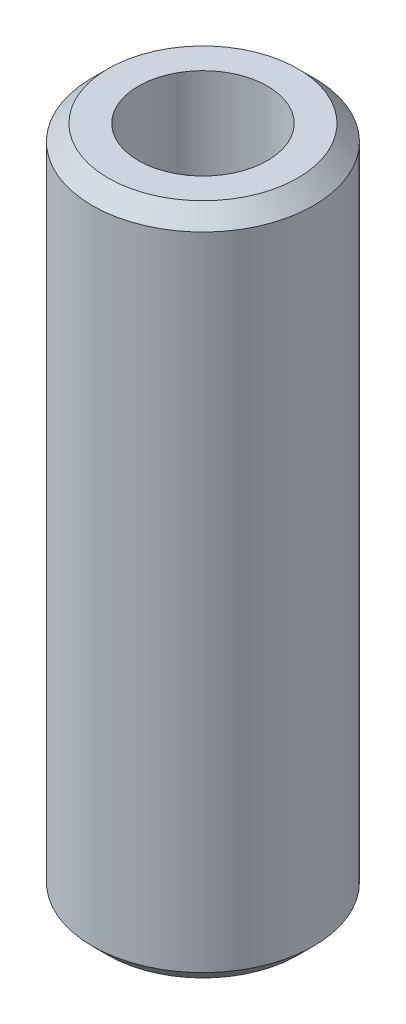
ISO-10303-21;
HEADER;
FILE_DESCRIPTION(('STEP AP214'),'2;1');
FILE_NAME('part.step','',(''),(''),'','','');
FILE_SCHEMA(('AUTOMOTIVE_DESIGN { 1 0 10303 214 1 1 1 1 }'));
ENDSEC;
DATA;
#1=APPLICATION_CONTEXT('core data for automotive mechanical design processes');
#2=APPLICATION_PROTOCOL_DEFINITION('international standard','automotive_design',2000,#1);
#3=PRODUCT_CONTEXT('',#1,'mechanical');
#4=PRODUCT('Part','Part','',(#3));
#5=PRODUCT_RELATED_PRODUCT_CATEGORY('part','',(#4));
#6=PRODUCT_DEFINITION_FORMATION('','',#4);
#7=PRODUCT_DEFINITION_CONTEXT('part definition',#1,'design');
#8=PRODUCT_DEFINITION('design','',#6,#7);
#9=PRODUCT_DEFINITION_SHAPE('','',#8);
#10=(LENGTH_UNIT() NAMED_UNIT(*) SI_UNIT(.MILLI.,.METRE.));
#11=(NAMED_UNIT(*) PLANE_ANGLE_UNIT() SI_UNIT($,.RADIAN.));
#12=(NAMED_UNIT(*) SI_UNIT($,.STERADIAN.) SOLID_ANGLE_UNIT());
#13=UNCERTAINTY_MEASURE_WITH_UNIT(LENGTH_MEASURE(1.E-05),#10,'distance_accuracy_value','');
#14=(GEOMETRIC_REPRESENTATION_CONTEXT(3) GLOBAL_UNCERTAINTY_ASSIGNED_CONTEXT((#13)) GLOBAL_UNIT_ASSIGNED_CONTEXT((#10,
#11,#12)) REPRESENTATION_CONTEXT('',''));
#15=CARTESIAN_POINT('',(0.,0.,0.));
#16=DIRECTION('',(0.,0.,1.));
#17=DIRECTION('',(1.,0.,0.));
#18=AXIS2_PLACEMENT_3D('',#15,#16,#17);
#19=CARTESIAN_POINT('',(0.,152.026612046149,0.));
#20=DIRECTION('',(0.,-1.,0.));
#21=DIRECTION('',(0.,0.,-1.));
#22=AXIS2_PLACEMENT_3D('',#19,#20,#21);
#23=CYLINDRICAL_SURFACE('',#22,25.);
#24=CARTESIAN_POINT('',(0.,148.439492911582,0.));
#25=DIRECTION('',(0.,1.,0.));
#26=DIRECTION('',(0.,0.,1.));
#27=AXIS2_PLACEMENT_3D('',#24,#25,#26);
#28=CIRCLE('',#27,25.);
#29=CARTESIAN_POINT('',(0.,148.439492911582,25.));
#30=VERTEX_POINT('',#29);
#31=EDGE_CURVE('E50',#30,#30,#28,.F.);
#32=ORIENTED_EDGE('',*,*,#31,.T.);
#33=EDGE_LOOP('',(#32));
#34=FACE_BOUND('',#33,.T.);
#35=CARTESIAN_POINT('',(0.,3.58711913456675,0.));
#36=DIRECTION('',(0.,1.,0.));
#37=DIRECTION('',(0.,0.,1.));
#38=AXIS2_PLACEMENT_3D('',#35,#36,#37);
#39=CIRCLE('',#38,25.);
#40=CARTESIAN_POINT('',(0.,3.58711913456675,25.));
#41=VERTEX_POINT('',#40);
#42=EDGE_CURVE('E51',#41,#41,#39,.T.);
#43=ORIENTED_EDGE('',*,*,#42,.T.);
#44=EDGE_LOOP('',(#43));
#45=FACE_BOUND('',#44,.T.);
#46=ADVANCED_FACE('F39',(#34,#45),#23,.T.);
#47=CARTESIAN_POINT('',(0.,152.026612046149,0.));
#48=DIRECTION('',(0.,1.,0.));
#49=DIRECTION('',(0.,0.,1.));
#50=AXIS2_PLACEMENT_3D('',#47,#48,#49);
#51=PLANE('',#50);
#52=CARTESIAN_POINT('',(0.,152.026612046149,0.));
#53=DIRECTION('',(0.,1.,0.));
#54=DIRECTION('',(0.,0.,1.));
#55=AXIS2_PLACEMENT_3D('',#52,#53,#54);
#56=CIRCLE('',#55,21.4128808654332);
#57=CARTESIAN_POINT('',(0.,152.026612046149,21.4128808654332));
#58=VERTEX_POINT('',#57);
#59=EDGE_CURVE('E54',#58,#58,#56,.T.);
#60=ORIENTED_EDGE('',*,*,#59,.T.);
#61=EDGE_LOOP('',(#60));
#62=FACE_BOUND('',#61,.T.);
#63=CARTESIAN_POINT('',(0.,152.026612046149,0.));
#64=DIRECTION('',(0.,1.,0.));
#65=DIRECTION('',(0.,0.,1.));
#66=AXIS2_PLACEMENT_3D('',#63,#64,#65);
#67=CIRCLE('',#66,14.5810609642156);
#68=CARTESIAN_POINT('',(0.,152.026612046149,14.5810609642156));
#69=VERTEX_POINT('',#68);
#70=EDGE_CURVE('E58',#69,#69,#67,.T.);
#71=ORIENTED_EDGE('',*,*,#70,.F.);
#72=EDGE_LOOP('',(#71));
#73=FACE_BOUND('',#72,.T.);
#74=ADVANCED_FACE('F69',(#62,#73),#51,.T.);
#75=CARTESIAN_POINT('',(0.,0.,0.));
#76=DIRECTION('',(0.,1.,0.));
#77=DIRECTION('',(0.,0.,1.));
#78=AXIS2_PLACEMENT_3D('',#75,#76,#77);
#79=PLANE('',#78);
#80=CARTESIAN_POINT('',(0.,0.,0.));
#81=DIRECTION('',(0.,1.,0.));
#82=DIRECTION('',(0.,0.,1.));
#83=AXIS2_PLACEMENT_3D('',#80,#81,#82);
#84=CIRCLE('',#83,21.4128808654332);
#85=CARTESIAN_POINT('',(0.,0.,21.4128808654332));
#86=VERTEX_POINT('',#85);
#87=EDGE_CURVE('E10',#86,#86,#84,.F.);
#88=ORIENTED_EDGE('',*,*,#87,.T.);
#89=EDGE_LOOP('',(#88));
#90=FACE_BOUND('',#89,.T.);
#91=CARTESIAN_POINT('',(0.,0.,0.));
#92=DIRECTION('',(0.,1.,0.));
#93=DIRECTION('',(0.,0.,1.));
#94=AXIS2_PLACEMENT_3D('',#91,#92,#93);
#95=CIRCLE('',#94,14.5810609642156);
#96=CARTESIAN_POINT('',(0.,0.,14.5810609642156));
#97=VERTEX_POINT('',#96);
#98=EDGE_CURVE('E63',#97,#97,#95,.T.);
#99=ORIENTED_EDGE('',*,*,#98,.T.);
#100=EDGE_LOOP('',(#99));
#101=FACE_BOUND('',#100,.T.);
#102=ADVANCED_FACE('F75',(#90,#101),#79,.F.);
#103=CARTESIAN_POINT('',(0.,152.026612046149,0.));
#104=DIRECTION('',(0.,-1.,0.));
#105=DIRECTION('',(0.,0.,-1.));
#106=AXIS2_PLACEMENT_3D('',#103,#104,#105);
#107=CYLINDRICAL_SURFACE('',#106,14.5810609642156);
#108=ORIENTED_EDGE('',*,*,#70,.T.);
#109=EDGE_LOOP('',(#108));
#110=FACE_BOUND('',#109,.T.);
#111=ORIENTED_EDGE('',*,*,#98,.F.);
#112=EDGE_LOOP('',(#111));
#113=FACE_BOUND('',#112,.T.);
#114=ADVANCED_FACE('F70',(#110,#113),#107,.F.);
#115=CARTESIAN_POINT('',(0.,152.026612046149,0.));
#116=DIRECTION('',(0.,-1.,0.));
#117=DIRECTION('',(0.,0.,-1.));
#118=AXIS2_PLACEMENT_3D('',#115,#116,#117);
#119=CONICAL_SURFACE('',#118,21.4128808654332,0.785398163397443);
#120=ORIENTED_EDGE('',*,*,#31,.F.);
#121=EDGE_LOOP('',(#120));
#122=FACE_BOUND('',#121,.T.);
#123=ORIENTED_EDGE('',*,*,#59,.F.);
#124=EDGE_LOOP('',(#123));
#125=FACE_BOUND('',#124,.T.);
#126=ADVANCED_FACE('F81',(#122,#125),#119,.T.);
#127=CARTESIAN_POINT('',(0.,3.58711913456675,0.));
#128=DIRECTION('',(0.,1.,0.));
#129=DIRECTION('',(0.,0.,1.));
#130=AXIS2_PLACEMENT_3D('',#127,#128,#129);
#131=CONICAL_SURFACE('',#130,25.,0.785398163397451);
#132=CARTESIAN_POINT('',(0.,0.,21.4128808654332));
#133=CARTESIAN_POINT('',(0.,0.0373658243184023,21.4502466897516));
#134=CARTESIAN_POINT('',(0.,0.0747316486368062,21.48761251407));
#135=CARTESIAN_POINT('',(0.,0.149463297273614,21.5623441627069));
#136=CARTESIAN_POINT('',(0.,0.186829121592018,21.5997099870253));
#137=CARTESIAN_POINT('',(0.,0.261560770228825,21.6744416356621));
#138=CARTESIAN_POINT('',(0.,0.298926594547229,21.7118074599805));
#139=CARTESIAN_POINT('',(0.,0.373658243184036,21.7865391086173));
#140=CARTESIAN_POINT('',(0.,0.411024067502439,21.8239049329357));
#141=CARTESIAN_POINT('',(0.,0.485755716139246,21.8986365815725));
#142=CARTESIAN_POINT('',(0.,0.52312154045765,21.9360024058909));
#143=CARTESIAN_POINT('',(0.,0.597853189094457,22.0107340545277));
#144=CARTESIAN_POINT('',(0.,0.635219013412861,22.0480998788461));
#145=CARTESIAN_POINT('',(0.,0.709950662049668,22.1228315274829));
#146=CARTESIAN_POINT('',(0.,0.747316486368072,22.1601973518013));
#147=CARTESIAN_POINT('',(0.,0.822048135004879,22.2349290004381));
#148=CARTESIAN_POINT('',(0.,0.859413959323283,22.2722948247565));
#149=CARTESIAN_POINT('',(0.,0.93414560796009,22.3470264733933));
#150=CARTESIAN_POINT('',(0.,0.971511432278493,22.3843922977117));
#151=CARTESIAN_POINT('',(0.,1.0462430809153,22.4591239463485));
#152=CARTESIAN_POINT('',(0.,1.0836089052337,22.4964897706669));
#153=CARTESIAN_POINT('',(0.,1.15834055387051,22.5712214193038));
#154=CARTESIAN_POINT('',(0.,1.19570637818892,22.6085872436222));
#155=CARTESIAN_POINT('',(0.,1.27043802682572,22.683318892259));
#156=CARTESIAN_POINT('',(0.,1.30780385114413,22.7206847165774));
#157=CARTESIAN_POINT('',(0.,1.38253549978093,22.7954163652142));
#158=CARTESIAN_POINT('',(0.,1.41990132409934,22.8327821895326));
#159=CARTESIAN_POINT('',(0.,1.49463297273614,22.9075138381694));
#160=CARTESIAN_POINT('',(0.,1.53199879705455,22.9448796624878));
#161=CARTESIAN_POINT('',(0.,1.60673044569135,23.0196113111246));
#162=CARTESIAN_POINT('',(0.,1.64409627000976,23.056977135443));
#163=CARTESIAN_POINT('',(0.,1.71882791864657,23.1317087840798));
#164=CARTESIAN_POINT('',(0.,1.75619374296497,23.1690746083982));
#165=CARTESIAN_POINT('',(0.,1.83092539160178,23.243806257035));
#166=CARTESIAN_POINT('',(0.,1.86829121592018,23.2811720813534));
#167=CARTESIAN_POINT('',(0.,1.94302286455699,23.3559037299902));
#168=CARTESIAN_POINT('',(0.,1.98038868887539,23.3932695543086));
#169=CARTESIAN_POINT('',(0.,2.0551203375122,23.4680012029454));
#170=CARTESIAN_POINT('',(0.,2.0924861618306,23.5053670272639));
#171=CARTESIAN_POINT('',(0.,2.16721781046741,23.5800986759007));
#172=CARTESIAN_POINT('',(0.,2.20458363478581,23.6174645002191));
#173=CARTESIAN_POINT('',(0.,2.27931528342262,23.6921961488559));
#174=CARTESIAN_POINT('',(0.,2.31668110774102,23.7295619731743));
#175=CARTESIAN_POINT('',(0.,2.39141275637783,23.8042936218111));
#176=CARTESIAN_POINT('',(0.,2.42877858069623,23.8416594461295));
#177=CARTESIAN_POINT('',(0.,2.50351022933304,23.9163910947663));
#178=CARTESIAN_POINT('',(0.,2.54087605365145,23.9537569190847));
#179=CARTESIAN_POINT('',(0.,2.61560770228825,24.0284885677215));
#180=CARTESIAN_POINT('',(0.,2.65297352660666,24.0658543920399));
#181=CARTESIAN_POINT('',(0.,2.72770517524346,24.1405860406767));
#182=CARTESIAN_POINT('',(0.,2.76507099956187,24.1779518649951));
#183=CARTESIAN_POINT('',(0.,2.83980264819867,24.2526835136319));
#184=CARTESIAN_POINT('',(0.,2.87716847251708,24.2900493379503));
#185=CARTESIAN_POINT('',(0.,2.95190012115388,24.3647809865871));
#186=CARTESIAN_POINT('',(0.,2.98926594547229,24.4021468109055));
#187=CARTESIAN_POINT('',(0.,3.0639975941091,24.4768784595423));
#188=CARTESIAN_POINT('',(0.,3.1013634184275,24.5142442838608));
#189=CARTESIAN_POINT('',(0.,3.17609506706431,24.5889759324976));
#190=CARTESIAN_POINT('',(0.,3.21346089138271,24.626341756816));
#191=CARTESIAN_POINT('',(0.,3.28819254001952,24.7010734054528));
#192=CARTESIAN_POINT('',(0.,3.32555836433792,24.7384392297712));
#193=CARTESIAN_POINT('',(0.,3.40029001297473,24.813170878408));
#194=CARTESIAN_POINT('',(0.,3.43765583729313,24.8505367027264));
#195=CARTESIAN_POINT('',(0.,3.51238748592994,24.9252683513632));
#196=CARTESIAN_POINT('',(0.,3.54975331024834,24.9626341756816));
#197=CARTESIAN_POINT('',(0.,3.58711913456675,25.));
#198=B_SPLINE_CURVE_WITH_KNOTS('',3,(#132,#133,#134,#135,#136,#137,#138,#139,#140,#141,#142,
#143,#144,#145,#146,#147,#148,#149,#150,#151,#152,#153,#154,#155,#156,#157,#158,#159,#160,#161,
#162,#163,#164,#165,#166,#167,#168,#169,#170,#171,#172,#173,#174,#175,#176,#177,#178,#179,#180,
#181,#182,#183,#184,#185,#186,#187,#188,#189,#190,#191,#192,#193,#194,#195,#196,#197),
.UNSPECIFIED.,.F.,.F.,(4,2,2,2,2,2,2,2,2,2,2,2,2,2,2,2,2,2,2,2,2,2,2,2,2,2,2,2,2,2,2,2,4),(0.,
0.158529766561011,0.31705953312202,0.47558929968303,0.634119066244042,0.792648832805052,
0.951178599366064,1.10970836592707,1.26823813248809,1.4267678990491,1.58529766561011,
1.74382743217112,1.90235719873213,2.06088696529314,2.21941673185415,2.37794649841516,
2.53647626497617,2.69500603153718,2.85353579809819,3.0120655646592,3.17059533122021,
3.32912509778123,3.48765486434224,3.64618463090325,3.80471439746426,3.96324416402527,
4.12177393058628,4.28030369714729,4.4388334637083,4.59736323026931,4.75589299683032,
4.91442276339133,5.07295252995234),.UNSPECIFIED.);
#199=EDGE_CURVE('BSEAM45',#86,#41,#198,.T.);
#200=ORIENTED_EDGE('',*,*,#87,.F.);
#201=ORIENTED_EDGE('',*,*,#42,.F.);
#202=ORIENTED_EDGE('',*,*,#199,.T.);
#203=ORIENTED_EDGE('',*,*,#199,.F.);
#204=EDGE_LOOP('',(#200,#202,#201,#203));
#205=FACE_BOUND('',#204,.T.);
#206=ADVANCED_FACE('F45',(#205),#131,.T.);
#207=CLOSED_SHELL('',(#46,#74,#102,#114,#126,#206));
#208=MANIFOLD_SOLID_BREP('B2',#207);
#209=ADVANCED_BREP_SHAPE_REPRESENTATION('',(#18,#208),#14);
#210=SHAPE_DEFINITION_REPRESENTATION(#9,#209);
ENDSEC;
END-ISO-10303-21;
